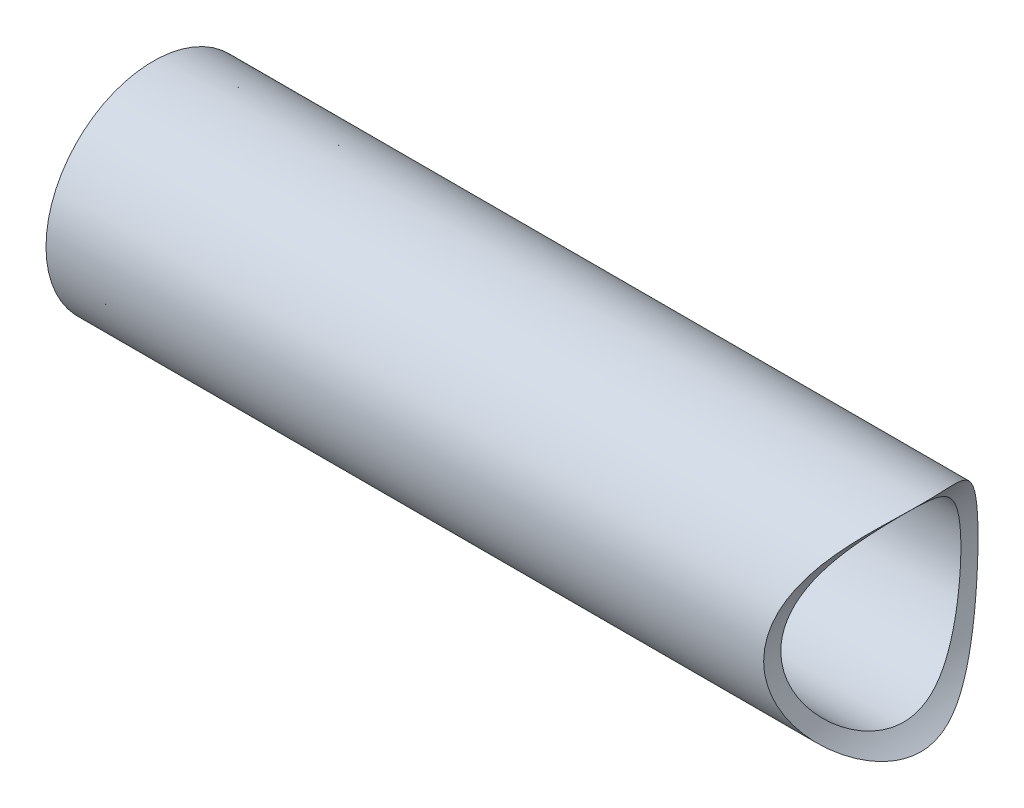
ISO-10303-21;
HEADER;
FILE_DESCRIPTION(('STEP AP214'),'2;1');
FILE_NAME('part.step','',(''),(''),'','','');
FILE_SCHEMA(('AUTOMOTIVE_DESIGN { 1 0 10303 214 1 1 1 1 }'));
ENDSEC;
DATA;
#1=APPLICATION_CONTEXT('core data for automotive mechanical design processes');
#2=APPLICATION_PROTOCOL_DEFINITION('international standard','automotive_design',2000,#1);
#3=PRODUCT_CONTEXT('',#1,'mechanical');
#4=PRODUCT('Part','Part','',(#3));
#5=PRODUCT_RELATED_PRODUCT_CATEGORY('part','',(#4));
#6=PRODUCT_DEFINITION_FORMATION('','',#4);
#7=PRODUCT_DEFINITION_CONTEXT('part definition',#1,'design');
#8=PRODUCT_DEFINITION('design','',#6,#7);
#9=PRODUCT_DEFINITION_SHAPE('','',#8);
#10=(LENGTH_UNIT() NAMED_UNIT(*) SI_UNIT(.MILLI.,.METRE.));
#11=(NAMED_UNIT(*) PLANE_ANGLE_UNIT() SI_UNIT($,.RADIAN.));
#12=(NAMED_UNIT(*) SI_UNIT($,.STERADIAN.) SOLID_ANGLE_UNIT());
#13=UNCERTAINTY_MEASURE_WITH_UNIT(LENGTH_MEASURE(1.E-05),#10,'distance_accuracy_value','');
#14=(GEOMETRIC_REPRESENTATION_CONTEXT(3) GLOBAL_UNCERTAINTY_ASSIGNED_CONTEXT((#13)) GLOBAL_UNIT_ASSIGNED_CONTEXT((#10,
#11,#12)) REPRESENTATION_CONTEXT('',''));
#15=CARTESIAN_POINT('',(0.,0.,0.));
#16=DIRECTION('',(0.,0.,1.));
#17=DIRECTION('',(1.,0.,0.));
#18=AXIS2_PLACEMENT_3D('',#15,#16,#17);
#19=CARTESIAN_POINT('',(76.2,0.,0.));
#20=DIRECTION('',(-1.,0.,0.));
#21=DIRECTION('',(0.,0.,1.));
#22=AXIS2_PLACEMENT_3D('',#19,#20,#21);
#23=CYLINDRICAL_SURFACE('',#22,9.525);
#24=CARTESIAN_POINT('',(63.7794,0.,9.525));
#25=CARTESIAN_POINT('',(63.779399362803,0.231436472206792,9.52500065416918));
#26=CARTESIAN_POINT('',(63.7858814172797,0.462864398155673,9.51655280556755));
#27=CARTESIAN_POINT('',(63.8116551576699,0.923867549602103,9.48290704231381));
#28=CARTESIAN_POINT('',(63.8309517494755,1.15344203144787,9.45770271263931));
#29=CARTESIAN_POINT('',(63.8819383576314,1.60913334522089,9.39092263303948));
#30=CARTESIAN_POINT('',(63.9136464232189,1.83524464096674,9.34932303989));
#31=CARTESIAN_POINT('',(63.9887299474654,2.28199399137669,9.25043088438929));
#32=CARTESIAN_POINT('',(64.0321044819407,2.50263247806925,9.19313956508417));
#33=CARTESIAN_POINT('',(64.1293079607293,2.93575812069893,9.06408939798475));
#34=CARTESIAN_POINT('',(64.1830732888483,3.14828590385986,8.99241849023557));
#35=CARTESIAN_POINT('',(64.3001767034404,3.56545273485888,8.8353187046899));
#36=CARTESIAN_POINT('',(64.3635149539591,3.77009164743443,8.74988959112518));
#37=CARTESIAN_POINT('',(64.4986085204896,4.17053717742766,8.56625645438419));
#38=CARTESIAN_POINT('',(64.5703603365211,4.36634742090213,8.46805774142585));
#39=CARTESIAN_POINT('',(64.7211618257725,4.7486659897162,8.25973441822145));
#40=CARTESIAN_POINT('',(64.800214216549,4.9351708111043,8.14960536437972));
#41=CARTESIAN_POINT('',(64.9720775144929,5.31531117666434,7.90749657884151));
#42=CARTESIAN_POINT('',(65.0654839683589,5.50798905726206,7.77443686581312));
#43=CARTESIAN_POINT('',(65.2580439625037,5.88124262987599,7.49605433717678));
#44=CARTESIAN_POINT('',(65.3571982718922,6.06181669530067,7.35072987925506));
#45=CARTESIAN_POINT('',(65.5598344791518,6.41084684109836,7.04840774969189));
#46=CARTESIAN_POINT('',(65.6633223899609,6.57928513834835,6.8913936066733));
#47=CARTESIAN_POINT('',(65.8728606671385,6.90353207519759,6.56654605685272));
#48=CARTESIAN_POINT('',(65.9789103530252,7.05934402185999,6.39871550386875));
#49=CARTESIAN_POINT('',(66.2145715292501,7.38999340039328,6.01585300120485));
#50=CARTESIAN_POINT('',(66.3444036148162,7.56184339037455,5.79836652951339));
#51=CARTESIAN_POINT('',(66.6022067561014,7.88648497876549,5.34845591569154));
#52=CARTESIAN_POINT('',(66.7301772207874,8.03927063640275,5.11602715130509));
#53=CARTESIAN_POINT('',(66.98035901494,8.32499414116026,4.63657959821472));
#54=CARTESIAN_POINT('',(67.1025751547944,8.45794877533152,4.38957339946405));
#55=CARTESIAN_POINT('',(67.3367559625488,8.70304160287996,3.88103172778459));
#56=CARTESIAN_POINT('',(67.4487264802147,8.81519171271391,3.61950468437537));
#57=CARTESIAN_POINT('',(67.6875780759142,9.04683015410528,3.00300092423355));
#58=CARTESIAN_POINT('',(67.8092650443693,9.15889779765476,2.64303684747714));
#59=CARTESIAN_POINT('',(67.9615600103406,9.29537962699193,2.08755617031534));
#60=CARTESIAN_POINT('',(68.0072674667644,9.33558904102313,1.89992349939526));
#61=CARTESIAN_POINT('',(68.0869075896764,9.40488294824299,1.52019487165071));
#62=CARTESIAN_POINT('',(68.1208464880973,9.43397333025127,1.32810133471719));
#63=CARTESIAN_POINT('',(68.1757323146001,9.48070466502802,0.938495407930132));
#64=CARTESIAN_POINT('',(68.1965333309205,9.49821712783424,0.74094675134673));
#65=CARTESIAN_POINT('',(68.2234754487842,9.52085482894756,0.344134768173952));
#66=CARTESIAN_POINT('',(68.2296171684056,9.52598058951382,0.144871514232479));
#67=CARTESIAN_POINT('',(68.2269039735099,9.52370967939927,-0.253502356034509));
#68=CARTESIAN_POINT('',(68.2180472152525,9.51631146916554,-0.452612950583561));
#69=CARTESIAN_POINT('',(68.1858166465852,9.48918368755466,-0.848791616912452));
#70=CARTESIAN_POINT('',(68.1624427956942,9.46945408179125,-1.04585968299512));
#71=CARTESIAN_POINT('',(68.1060797684732,9.42130244787611,-1.41227018136049));
#72=CARTESIAN_POINT('',(68.074630882085,9.39425158725262,-1.58203603454464));
#73=CARTESIAN_POINT('',(68.0025931921617,9.33145810633124,-1.91800632074385));
#74=CARTESIAN_POINT('',(67.9620011503969,9.2957124062244,-2.08420946906053));
#75=CARTESIAN_POINT('',(67.8282959569905,9.17606440343975,-2.57673988937795));
#76=CARTESIAN_POINT('',(67.7232647952137,9.07976020110264,-2.89692168303918));
#77=CARTESIAN_POINT('',(67.5115868113792,8.8769566703694,-3.46405584331542));
#78=CARTESIAN_POINT('',(67.4083931356038,8.77513794932227,-3.71406420474107));
#79=CARTESIAN_POINT('',(67.1918108003263,8.55265699236216,-4.20111250998644));
#80=CARTESIAN_POINT('',(67.0784165574875,8.43198440973093,-4.43814523594382));
#81=CARTESIAN_POINT('',(66.8452556500426,8.17254897525642,-4.89951889863966));
#82=CARTESIAN_POINT('',(66.7254759074781,8.03374808144068,-5.12383168189626));
#83=CARTESIAN_POINT('',(66.4831501211279,7.73889857479201,-5.55915092907223));
#84=CARTESIAN_POINT('',(66.3606045413706,7.58285283828382,-5.77015960283511));
#85=CARTESIAN_POINT('',(66.1117319537479,7.24865037001269,-6.18513553607477));
#86=CARTESIAN_POINT('',(65.9854084241279,7.06994890280247,-6.38866649524824));
#87=CARTESIAN_POINT('',(65.735715514632,6.69483595889118,-6.78073735269047));
#88=CARTESIAN_POINT('',(65.6123464346733,6.49842269376286,-6.96927573347671));
#89=CARTESIAN_POINT('',(65.3714365075329,6.08850959727958,-7.33008214397158));
#90=CARTESIAN_POINT('',(65.253886635298,5.87503765845942,-7.502375768871));
#91=CARTESIAN_POINT('',(65.0270040199746,5.4311650307461,-7.82969130532199));
#92=CARTESIAN_POINT('',(64.9176694143871,5.20076820249461,-7.98471713555689));
#93=CARTESIAN_POINT('',(64.7289598712517,4.76776406256953,-8.24899844084359));
#94=CARTESIAN_POINT('',(64.6477791738046,4.56787246945194,-8.36142140468544));
#95=CARTESIAN_POINT('',(64.4939694484531,4.15789169757287,-8.5726725985223));
#96=CARTESIAN_POINT('',(64.4213386889263,3.94780459592659,-8.67150358199145));
#97=CARTESIAN_POINT('',(64.2859940602519,3.51830121578144,-8.85447040001197));
#98=CARTESIAN_POINT('',(64.2232771511847,3.29888782332425,-8.93861074003843));
#99=CARTESIAN_POINT('',(64.1090201454439,2.85179539255544,-9.09113124308109));
#100=CARTESIAN_POINT('',(64.0574801564762,2.62411627461613,-9.15951125422386));
#101=CARTESIAN_POINT('',(63.9664138861099,2.16030411195371,-9.27989828905739));
#102=CARTESIAN_POINT('',(63.926975610251,1.92412247657988,-9.33178546769879));
#103=CARTESIAN_POINT('',(63.8615837604551,1.44666490781843,-9.41762232052789));
#104=CARTESIAN_POINT('',(63.83563024052,1.2053889540338,-9.45157192288161));
#105=CARTESIAN_POINT('',(63.7978951082864,0.719955398800779,-9.50088304153702));
#106=CARTESIAN_POINT('',(63.7861066835082,0.475799239642207,-9.51625349320997));
#107=CARTESIAN_POINT('',(63.7770004699775,-0.013229056675931,-9.52812963748889));
#108=CARTESIAN_POINT('',(63.7796812331561,-0.258101119736768,-9.52463721788116));
#109=CARTESIAN_POINT('',(63.7983000612292,-0.718309488258174,-9.50034366564152));
#110=CARTESIAN_POINT('',(63.8126865443844,-0.933820218489187,-9.48156817658183));
#111=CARTESIAN_POINT('',(63.8524372664706,-1.3620711874187,-9.42957622697699));
#112=CARTESIAN_POINT('',(63.8778016698848,-1.57481138455685,-9.39635955005813));
#113=CARTESIAN_POINT('',(63.9389971458371,-1.99610404206926,-9.31596427736967));
#114=CARTESIAN_POINT('',(63.9748287855012,-2.2046562748806,-9.26878492508555));
#115=CARTESIAN_POINT('',(64.0562709776962,-2.61633103995432,-9.16109790989434));
#116=CARTESIAN_POINT('',(64.1018819805888,-2.81945332167051,-9.10058963315665));
#117=CARTESIAN_POINT('',(64.2030327767432,-3.22307098357538,-8.96568879463712));
#118=CARTESIAN_POINT('',(64.2587464653645,-3.42344095053091,-8.89105185202455));
#119=CARTESIAN_POINT('',(64.378536077822,-3.81661958374558,-8.7295049917767));
#120=CARTESIAN_POINT('',(64.4426147766148,-4.0094257130983,-8.64259100064106));
#121=CARTESIAN_POINT('',(64.6458429224084,-4.57527665111366,-8.36474126032496));
#122=CARTESIAN_POINT('',(64.7960602846943,-4.9360476210105,-8.15659798994219));
#123=CARTESIAN_POINT('',(65.1436838109893,-5.67648706050478,-7.66367785805959));
#124=CARTESIAN_POINT('',(65.3447924376481,-6.04976098466468,-7.37195000900286));
#125=CARTESIAN_POINT('',(65.6579773243973,-6.57102834340501,-6.89944847469121));
#126=CARTESIAN_POINT('',(65.7644354149777,-6.73853193440252,-6.73589928068553));
#127=CARTESIAN_POINT('',(65.9794764271902,-7.06042597836889,-6.39769354577276));
#128=CARTESIAN_POINT('',(66.0880588841248,-7.21481926056848,-6.22303941563295));
#129=CARTESIAN_POINT('',(66.3278464186223,-7.54060641556453,-5.82611828074258));
#130=CARTESIAN_POINT('',(66.4591275264129,-7.70900035357449,-5.60142875546691));
#131=CARTESIAN_POINT('',(66.7186982579511,-8.02609532104232,-5.13678637263381));
#132=CARTESIAN_POINT('',(66.8469868317575,-8.17478952192015,-4.89682826492412));
#133=CARTESIAN_POINT('',(67.0962327112571,-8.45146900851773,-4.40209788648936));
#134=CARTESIAN_POINT('',(67.2172003908911,-8.57948404837262,-4.14734763052015));
#135=CARTESIAN_POINT('',(67.4469281711995,-8.81373537260308,-3.62300745078908));
#136=CARTESIAN_POINT('',(67.5556967033428,-8.91998674148399,-3.35342797075473));
#137=CARTESIAN_POINT('',(67.7794462126163,-9.13207717445722,-2.73183423512736));
#138=CARTESIAN_POINT('',(67.8895070204397,-9.23153406691642,-2.37571414667646));
#139=CARTESIAN_POINT('',(68.0235004369842,-9.34985053621102,-1.82779908361296));
#140=CARTESIAN_POINT('',(68.0629665672694,-9.38413242577134,-1.64299458129213));
#141=CARTESIAN_POINT('',(68.1300583006722,-9.44189143853665,-1.26962031166534));
#142=CARTESIAN_POINT('',(68.1576898827328,-9.46537401811433,-1.08105249614349));
#143=CARTESIAN_POINT('',(68.2000632101189,-9.50121586662459,-0.699669581741723));
#144=CARTESIAN_POINT('',(68.2146862886907,-9.51347276138143,-0.506831504724525));
#145=CARTESIAN_POINT('',(68.2298788272783,-9.52620462979875,-0.120213023644605));
#146=CARTESIAN_POINT('',(68.2304489533361,-9.52668016183883,0.0735673353231127));
#147=CARTESIAN_POINT('',(68.2175017127931,-9.51583383936208,0.460436906105756));
#148=CARTESIAN_POINT('',(68.2039757650115,-9.50450479864827,0.653525625031628));
#149=CARTESIAN_POINT('',(68.1635120034495,-9.47031454201255,1.03725259647442));
#150=CARTESIAN_POINT('',(68.1365725463107,-9.44745191304646,1.22789054579843));
#151=CARTESIAN_POINT('',(68.0665256385845,-9.3872398714988,1.62822875542732));
#152=CARTESIAN_POINT('',(68.0218552461002,-9.34847132907535,1.83744151729501));
#153=CARTESIAN_POINT('',(67.9194859049264,-9.25791914143967,2.24970096573933));
#154=CARTESIAN_POINT('',(67.8617848007023,-9.20613334275822,2.45274662584517));
#155=CARTESIAN_POINT('',(67.6725031187901,-9.03229175651722,3.05232285243323));
#156=CARTESIAN_POINT('',(67.5248755681115,-8.8918572144253,3.43862080190499));
#157=CARTESIAN_POINT('',(67.2515941405111,-8.61530393250275,4.07241175621149));
#158=CARTESIAN_POINT('',(67.1320914913077,-8.48987506809722,4.32752519598996));
#159=CARTESIAN_POINT('',(66.8854692545082,-8.21854031209348,4.82295869473442));
#160=CARTESIAN_POINT('',(66.7583467028124,-8.07262642192172,5.06327292222327));
#161=CARTESIAN_POINT('',(66.5005799080562,-7.76102530670267,5.52908154160372));
#162=CARTESIAN_POINT('',(66.3699321319541,-7.59531762751492,5.75456022341371));
#163=CARTESIAN_POINT('',(66.1087707984836,-7.24473427653126,6.1901189055732));
#164=CARTESIAN_POINT('',(65.978257225033,-7.05986126249871,6.40020103416943));
#165=CARTESIAN_POINT('',(65.717886615051,-6.66732271296994,6.80839282924573));
#166=CARTESIAN_POINT('',(65.5880957681832,-6.45927305118149,7.0061760596552));
#167=CARTESIAN_POINT('',(65.3349977175316,-6.02382368081853,7.3839176153565));
#168=CARTESIAN_POINT('',(65.2116913626445,-5.79642144891574,7.5638736095639));
#169=CARTESIAN_POINT('',(64.9748306396163,-5.32322840810642,7.90402499886499));
#170=CARTESIAN_POINT('',(64.8612590566319,-5.07747156086127,8.06425550478491));
#171=CARTESIAN_POINT('',(64.6466584303483,-4.56813758123173,8.36330439759627));
#172=CARTESIAN_POINT('',(64.5456240035404,-4.30456817326193,8.50213198124598));
#173=CARTESIAN_POINT('',(64.3840955804316,-3.83404789620802,8.72203395304521));
#174=CARTESIAN_POINT('',(64.3199985654127,-3.63088565364963,8.80860877816486));
#175=CARTESIAN_POINT('',(64.201213198017,-3.21664600434511,8.96816849458349));
#176=CARTESIAN_POINT('',(64.1465226502606,-3.00557045853359,9.04115655723143));
#177=CARTESIAN_POINT('',(64.0476773835362,-2.57694381497108,9.17252057206869));
#178=CARTESIAN_POINT('',(64.0035034927803,-2.3594053265205,9.23092312321565));
#179=CARTESIAN_POINT('',(63.9264867477976,-1.91889338005474,9.33244564934182));
#180=CARTESIAN_POINT('',(63.8936399290592,-1.69592185293494,9.37557097154482));
#181=CARTESIAN_POINT('',(63.8379433043172,-1.22892425191583,9.44856438615263));
#182=CARTESIAN_POINT('',(63.816042905947,-0.984585840166762,9.47717595428305));
#183=CARTESIAN_POINT('',(63.7867698897909,-0.493495415887894,9.51539564101578));
#184=CARTESIAN_POINT('',(63.7794006793389,-0.246742850905352,9.52499930256641));
#185=CARTESIAN_POINT('',(63.7794,0.,9.525));
#186=B_SPLINE_CURVE_WITH_KNOTS('',3,(#24,#25,#26,#27,#28,#29,#30,#31,#32,#33,#34,#35,#36,#37,
#38,#39,#40,#41,#42,#43,#44,#45,#46,#47,#48,#49,#50,#51,#52,#53,#54,#55,#56,#57,#58,#59,#60,#61,
#62,#63,#64,#65,#66,#67,#68,#69,#70,#71,#72,#73,#74,#75,#76,#77,#78,#79,#80,#81,#82,#83,#84,#85,
#86,#87,#88,#89,#90,#91,#92,#93,#94,#95,#96,#97,#98,#99,#100,#101,#102,#103,#104,#105,#106,#107,
#108,#109,#110,#111,#112,#113,#114,#115,#116,#117,#118,#119,#120,#121,#122,#123,#124,#125,#126,
#127,#128,#129,#130,#131,#132,#133,#134,#135,#136,#137,#138,#139,#140,#141,#142,#143,#144,#145,
#146,#147,#148,#149,#150,#151,#152,#153,#154,#155,#156,#157,#158,#159,#160,#161,#162,#163,#164,
#165,#166,#167,#168,#169,#170,#171,#172,#173,#174,#175,#176,#177,#178,#179,#180,#181,#182,#183,
#184,#185),.UNSPECIFIED.,.T.,.F.,(4,2,2,2,2,2,2,2,2,2,2,2,2,2,2,2,2,2,2,2,2,2,2,2,2,2,2,2,2,2,2,
2,2,2,2,2,2,2,2,2,2,2,2,2,2,2,2,2,2,2,2,2,2,2,2,2,2,2,2,2,2,2,2,2,2,2,2,2,2,2,2,2,2,2,2,2,2,2,2,
2,4),(0.,0.694052314381817,1.38837049168413,2.08370214671893,2.77897873582605,3.47012623194972,
4.16128557321997,4.85215841063313,5.54328946228478,6.29888945333361,7.05459078421412,
7.81137786048359,8.56796607591286,9.48524066866299,10.4028003898026,11.3195789297932,
12.2358307231354,13.4196450827176,14.0108467531759,14.6017348783564,15.1990751728768,
15.7963902813642,16.3937788222322,16.9911690289331,17.5149254872419,18.0388677367696,
19.0869542588054,19.9528908474694,20.8193043292906,21.6875660904866,22.5556832493657,
23.4513642096872,24.3471357117903,25.2414713900713,26.1356036961508,26.8647667366702,
27.5937818444899,28.3225729763421,29.0513711308512,29.7853500467609,30.5193319019871,
31.2529606187273,31.9865159156496,32.6361597683986,33.2858133551593,33.9355021473776,
34.5852208656608,35.2474202717584,35.90983991267,37.2337308951925,38.7719282241411,
39.5429913105487,40.3138875748722,41.2427622524398,42.1719580709167,43.0998047757498,
44.02700619308,45.1796590299573,45.7552470763935,46.3305439854622,46.9110366172618,
47.4915017364661,48.0723204284085,48.6532102969737,49.3044501867198,49.9557978832933,
51.2605454430235,52.1847086357085,53.1092336855447,54.0347225061591,54.9600831553503,
55.9040849718865,56.8482100633556,57.7906295641961,58.7326429752791,59.4218435013519,
60.110882955679,60.7986565093536,61.4861890951628,62.225970095486,62.965924542143),.UNSPECIFIED.);
#187=CARTESIAN_POINT('',(63.7794,0.,9.525));
#188=VERTEX_POINT('',#187);
#189=EDGE_CURVE('E55',#188,#188,#186,.T.);
#190=ORIENTED_EDGE('',*,*,#189,.T.);
#191=EDGE_LOOP('',(#190));
#192=FACE_BOUND('',#191,.T.);
#193=CARTESIAN_POINT('',(0.,0.,0.));
#194=DIRECTION('',(1.,0.,0.));
#195=DIRECTION('',(0.,0.,-1.));
#196=AXIS2_PLACEMENT_3D('',#193,#194,#195);
#197=CIRCLE('',#196,9.525);
#198=CARTESIAN_POINT('',(0.,0.,-9.525));
#199=VERTEX_POINT('',#198);
#200=EDGE_CURVE('E10',#199,#199,#197,.T.);
#201=ORIENTED_EDGE('',*,*,#200,.T.);
#202=EDGE_LOOP('',(#201));
#203=FACE_BOUND('',#202,.T.);
#204=ADVANCED_FACE('F30',(#192,#203),#23,.T.);
#205=CARTESIAN_POINT('',(0.,0.,0.));
#206=DIRECTION('',(1.,0.,0.));
#207=DIRECTION('',(0.,0.,-1.));
#208=AXIS2_PLACEMENT_3D('',#205,#206,#207);
#209=PLANE('',#208);
#210=CARTESIAN_POINT('',(0.,0.,0.));
#211=DIRECTION('',(-1.,0.,0.));
#212=DIRECTION('',(0.,0.,1.));
#213=AXIS2_PLACEMENT_3D('',#210,#211,#212);
#214=CIRCLE('',#213,8.509);
#215=CARTESIAN_POINT('',(0.,0.,8.509));
#216=VERTEX_POINT('',#215);
#217=EDGE_CURVE('E47',#216,#216,#214,.T.);
#218=ORIENTED_EDGE('',*,*,#217,.F.);
#219=EDGE_LOOP('',(#218));
#220=FACE_BOUND('',#219,.T.);
#221=ORIENTED_EDGE('',*,*,#200,.F.);
#222=EDGE_LOOP('',(#221));
#223=FACE_BOUND('',#222,.T.);
#224=ADVANCED_FACE('F76',(#220,#223),#209,.F.);
#225=CARTESIAN_POINT('',(1.524,0.,0.));
#226=DIRECTION('',(-1.,0.,0.));
#227=DIRECTION('',(0.,0.,1.));
#228=AXIS2_PLACEMENT_3D('',#225,#226,#227);
#229=CYLINDRICAL_SURFACE('',#228,8.509);
#230=CARTESIAN_POINT('',(1.524,0.,0.));
#231=DIRECTION('',(-1.,0.,0.));
#232=DIRECTION('',(0.,0.,1.));
#233=AXIS2_PLACEMENT_3D('',#230,#231,#232);
#234=CIRCLE('',#233,8.509);
#235=CARTESIAN_POINT('',(1.524,0.,8.509));
#236=VERTEX_POINT('',#235);
#237=EDGE_CURVE('E43',#236,#236,#234,.T.);
#238=ORIENTED_EDGE('',*,*,#237,.F.);
#239=EDGE_LOOP('',(#238));
#240=FACE_BOUND('',#239,.T.);
#241=ORIENTED_EDGE('',*,*,#217,.T.);
#242=EDGE_LOOP('',(#241));
#243=FACE_BOUND('',#242,.T.);
#244=ADVANCED_FACE('F73',(#240,#243),#229,.F.);
#245=CARTESIAN_POINT('',(1.524,0.,0.));
#246=DIRECTION('',(-1.,0.,0.));
#247=DIRECTION('',(0.,0.,1.));
#248=AXIS2_PLACEMENT_3D('',#245,#246,#247);
#249=PLANE('',#248);
#250=CARTESIAN_POINT('',(1.524,0.,0.));
#251=DIRECTION('',(-1.,0.,0.));
#252=DIRECTION('',(0.,0.,1.));
#253=AXIS2_PLACEMENT_3D('',#250,#251,#252);
#254=CIRCLE('',#253,8.001);
#255=CARTESIAN_POINT('',(1.524,0.,8.001));
#256=VERTEX_POINT('',#255);
#257=EDGE_CURVE('E51',#256,#256,#254,.T.);
#258=ORIENTED_EDGE('',*,*,#257,.F.);
#259=EDGE_LOOP('',(#258));
#260=FACE_BOUND('',#259,.T.);
#261=ORIENTED_EDGE('',*,*,#237,.T.);
#262=EDGE_LOOP('',(#261));
#263=FACE_BOUND('',#262,.T.);
#264=ADVANCED_FACE('F69',(#260,#263),#249,.T.);
#265=CARTESIAN_POINT('',(76.2,0.,0.));
#266=DIRECTION('',(-1.,0.,0.));
#267=DIRECTION('',(0.,0.,1.));
#268=AXIS2_PLACEMENT_3D('',#265,#266,#267);
#269=CYLINDRICAL_SURFACE('',#268,8.001);
#270=CARTESIAN_POINT('',(63.7794,0.,8.001));
#271=CARTESIAN_POINT('',(63.7793946400964,-0.202343962933734,8.00100568253379));
#272=CARTESIAN_POINT('',(63.7843521565646,-0.404634301311018,7.99331812680323));
#273=CARTESIAN_POINT('',(63.8040456436651,-0.807641948046263,7.96269610871055));
#274=CARTESIAN_POINT('',(63.8187835641105,-1.00835893466737,7.93975860613026));
#275=CARTESIAN_POINT('',(63.8576955741624,-1.40674639939101,7.87894141337915));
#276=CARTESIAN_POINT('',(63.8818776369006,-1.60441415624606,7.84104909745644));
#277=CARTESIAN_POINT('',(63.9390933478802,-1.99510666034114,7.75085437489078));
#278=CARTESIAN_POINT('',(63.9721266792101,-2.18813157354434,7.69855248416757));
#279=CARTESIAN_POINT('',(64.0461061136419,-2.56735432883484,7.58049718418202));
#280=CARTESIAN_POINT('',(64.0870118603721,-2.75358146085736,7.51481228357135));
#281=CARTESIAN_POINT('',(64.1759862198577,-3.11926757327123,7.37053783772798));
#282=CARTESIAN_POINT('',(64.2240576091601,-3.29872389617889,7.29194328904945));
#283=CARTESIAN_POINT('',(64.3263748993374,-3.64989811988732,7.12265542503683));
#284=CARTESIAN_POINT('',(64.3806181398669,-3.82161931065637,7.03196731969151));
#285=CARTESIAN_POINT('',(64.4942816038626,-4.15678124396449,6.83919444174471));
#286=CARTESIAN_POINT('',(64.5537037509152,-4.32021887381087,6.73710543054219));
#287=CARTESIAN_POINT('',(64.7482305904397,-4.82328263281791,6.39720589334998));
#288=CARTESIAN_POINT('',(64.8910087021521,-5.14684395183643,6.13958946996772));
#289=CARTESIAN_POINT('',(65.184904540806,-5.74904373316614,5.5797806697578));
#290=CARTESIAN_POINT('',(65.3360335741384,-6.02761918416159,5.27752688427977));
#291=CARTESIAN_POINT('',(65.5704389857406,-6.42746748113265,4.77063494263404));
#292=CARTESIAN_POINT('',(65.6551490509337,-6.56513696701627,4.57938308321824));
#293=CARTESIAN_POINT('',(65.8206697834638,-6.82380847263964,4.18418605343312));
#294=CARTESIAN_POINT('',(65.9014796482172,-6.94480707126332,3.98023829010391));
#295=CARTESIAN_POINT('',(66.0562467732735,-7.16896876581615,3.56067251075514));
#296=CARTESIAN_POINT('',(66.1302132933233,-7.27215613092057,3.34507090883863));
#297=CARTESIAN_POINT('',(66.2683458109258,-7.45969981233103,2.90284270432325));
#298=CARTESIAN_POINT('',(66.3325162059907,-7.54406458605504,2.67622110923339));
#299=CARTESIAN_POINT('',(66.4321468249734,-7.67235472878842,2.27645230875051));
#300=CARTESIAN_POINT('',(66.4706638589501,-7.72103375481348,2.10557991639857));
#301=CARTESIAN_POINT('',(66.5396422371559,-7.80716600410319,1.7595224468521));
#302=CARTESIAN_POINT('',(66.5701087165434,-7.84462638538055,1.58434019710161));
#303=CARTESIAN_POINT('',(66.6219283447228,-7.90781397071006,1.23073118250659));
#304=CARTESIAN_POINT('',(66.6432914254727,-7.93355396401226,1.05230817619955));
#305=CARTESIAN_POINT('',(66.6761406746397,-7.972958729551,0.693216939486897));
#306=CARTESIAN_POINT('',(66.6876267416012,-7.98662337775077,0.51254868603765));
#307=CARTESIAN_POINT('',(66.7002759651701,-8.00166527272688,0.149743067270615));
#308=CARTESIAN_POINT('',(66.7014052672797,-8.00300222243674,-0.0323971695041566));
#309=CARTESIAN_POINT('',(66.6932052720287,-7.99325949412813,-0.396106150418002));
#310=CARTESIAN_POINT('',(66.683875924078,-7.98217975604839,-0.57767489178841));
#311=CARTESIAN_POINT('',(66.6551322039937,-7.94778591533977,-0.938965385584156));
#312=CARTESIAN_POINT('',(66.6357105530713,-7.92446298252817,-1.11868570936035));
#313=CARTESIAN_POINT('',(66.5875352133659,-7.86595545752498,-1.47490051215752));
#314=CARTESIAN_POINT('',(66.5587813306084,-7.83077061877814,-1.651394924046));
#315=CARTESIAN_POINT('',(66.4940273244739,-7.75035282954256,-1.99451090304557));
#316=CARTESIAN_POINT('',(66.4582906588384,-7.70548033648056,-2.16126732727847));
#317=CARTESIAN_POINT('',(66.3800982826475,-7.60558070573934,-2.49012104369776));
#318=CARTESIAN_POINT('',(66.3376402680587,-7.55055008484402,-2.65221671561231));
#319=CARTESIAN_POINT('',(66.2018759686064,-7.37097836842628,-3.13059444655762));
#320=CARTESIAN_POINT('',(66.1001437267516,-7.23191492894561,-3.43914543228212));
#321=CARTESIAN_POINT('',(65.8618646957808,-6.88810886980982,-4.09035016179098));
#322=CARTESIAN_POINT('',(65.7223977662518,-6.67584592726078,-4.42791548383197));
#323=CARTESIAN_POINT('',(65.4368791316555,-6.20502747147192,-5.06666741460046));
#324=CARTESIAN_POINT('',(65.2908197157638,-5.94641664009327,-5.3678098237134));
#325=CARTESIAN_POINT('',(65.0620100472751,-5.50013958839756,-5.81549323279107));
#326=CARTESIAN_POINT('',(64.9776248875144,-5.326280029984,-5.97517506357792));
#327=CARTESIAN_POINT('',(64.8127250337856,-4.96395518330921,-6.27941849348534));
#328=CARTESIAN_POINT('',(64.7322109982055,-4.77548742467182,-6.42397752545192));
#329=CARTESIAN_POINT('',(64.577266849983,-4.3849167260173,-6.69665507687266));
#330=CARTESIAN_POINT('',(64.5028316745189,-4.18282539396592,-6.82478732923586));
#331=CARTESIAN_POINT('',(64.3620088991569,-3.76585300183825,-7.06342766698651));
#332=CARTESIAN_POINT('',(64.295619066058,-3.5509755157087,-7.17394064577722));
#333=CARTESIAN_POINT('',(64.1849873013877,-3.15349123836704,-7.35590574415692));
#334=CARTESIAN_POINT('',(64.1389636831921,-2.97292972941127,-7.43075839572842));
#335=CARTESIAN_POINT('',(64.0542489456726,-2.60530140744678,-7.56748621455111));
#336=CARTESIAN_POINT('',(64.0155564910518,-2.41823578645619,-7.62936374530827));
#337=CARTESIAN_POINT('',(63.9463495781067,-2.03875675339343,-7.73941049085683));
#338=CARTESIAN_POINT('',(63.9158300439369,-1.84634674283533,-7.78758821515812));
#339=CARTESIAN_POINT('',(63.8636286716177,-1.45731248608469,-7.8696733493385));
#340=CARTESIAN_POINT('',(63.8419469934688,-1.26068816366412,-7.90358050086363));
#341=CARTESIAN_POINT('',(63.8078786249426,-0.863949685194311,-7.95674479502144));
#342=CARTESIAN_POINT('',(63.7955251174134,-0.663825637622842,-7.9759496408611));
#343=CARTESIAN_POINT('',(63.7805459493643,-0.262332965606738,-7.9992259212937));
#344=CARTESIAN_POINT('',(63.7779202924526,-0.0609643407004882,-8.00329735027331));
#345=CARTESIAN_POINT('',(63.7824627324994,0.341403235934272,-7.99624508151412));
#346=CARTESIAN_POINT('',(63.7896312794518,0.542402170252499,-7.98512068560425));
#347=CARTESIAN_POINT('',(63.8135839096452,0.942414478991548,-7.94784273989207));
#348=CARTESIAN_POINT('',(63.8303677213917,1.14142790931321,-7.92168961443765));
#349=CARTESIAN_POINT('',(63.8719390987528,1.52489749230377,-7.85661312885272));
#350=CARTESIAN_POINT('',(63.8962255936347,1.70954456912131,-7.81848727781831));
#351=CARTESIAN_POINT('',(63.9524986078993,2.07464280901035,-7.72962932491453));
#352=CARTESIAN_POINT('',(63.9844877632522,2.25509251244314,-7.6788929073213));
#353=CARTESIAN_POINT('',(64.0555135858445,2.61067394041211,-7.56539523057578));
#354=CARTESIAN_POINT('',(64.0945481951005,2.78580720048136,-7.5026374825379));
#355=CARTESIAN_POINT('',(64.178949788136,3.13002899466611,-7.36568071837875));
#356=CARTESIAN_POINT('',(64.2243191884561,3.29911519093464,-7.29147733494002));
#357=CARTESIAN_POINT('',(64.3240449564697,3.64241461059529,-7.12654406778394));
#358=CARTESIAN_POINT('',(64.3788129446052,3.8161223607132,-7.03500953221609));
#359=CARTESIAN_POINT('',(64.4936455029448,4.15507616844295,-6.84029219591951));
#360=CARTESIAN_POINT('',(64.5537122889448,4.32031864003875,-6.7371045170992));
#361=CARTESIAN_POINT('',(64.7403058729329,4.80263243268735,-6.41102439407078));
#362=CARTESIAN_POINT('',(64.8732437510453,5.10634956414892,-6.17158603361194));
#363=CARTESIAN_POINT('',(65.0888348144914,5.5539677631477,-5.76356533039375));
#364=CARTESIAN_POINT('',(65.1689895628863,5.71115467541917,-5.60781611873476));
#365=CARTESIAN_POINT('',(65.3300456540849,6.01202573716453,-5.28397184257657));
#366=CARTESIAN_POINT('',(65.4109471616974,6.15570682369188,-5.11587399289105));
#367=CARTESIAN_POINT('',(65.5715054469686,6.42896167386975,-4.76795739086536));
#368=CARTESIAN_POINT('',(65.6511618828033,6.55853161972917,-4.58813548749718));
#369=CARTESIAN_POINT('',(65.8070747486137,6.80289661447325,-4.21733097077083));
#370=CARTESIAN_POINT('',(65.8833316920624,6.91769389965591,-4.02635005305353));
#371=CARTESIAN_POINT('',(66.020599533957,7.11785606349911,-3.65923268781192));
#372=CARTESIAN_POINT('',(66.082305058479,7.20510719618136,-3.48438349435571));
#373=CARTESIAN_POINT('',(66.1997347985259,7.36722608054,-3.12705408544431));
#374=CARTESIAN_POINT('',(66.2554586803237,7.44209314141164,-2.94457344500476));
#375=CARTESIAN_POINT('',(66.3591314932601,7.57865169472792,-2.57278358656977));
#376=CARTESIAN_POINT('',(66.4070876198348,7.64035539766742,-2.38348088905907));
#377=CARTESIAN_POINT('',(66.4935234864995,7.74987040388961,-1.99886480677391));
#378=CARTESIAN_POINT('',(66.5320080031076,7.79768871175284,-1.8035545077608));
#379=CARTESIAN_POINT('',(66.5982619277052,7.87913242862878,-1.40600731199598));
#380=CARTESIAN_POINT('',(66.6259159203961,7.91260530255462,-1.20371954928518));
#381=CARTESIAN_POINT('',(66.6686017488969,7.9639737488639,-0.795840808630466));
#382=CARTESIAN_POINT('',(66.6836339511313,7.98186977346105,-0.590249926756372));
#383=CARTESIAN_POINT('',(66.7002868673064,8.0016827100989,-0.177899818012241));
#384=CARTESIAN_POINT('',(66.7019172855936,8.00361118438693,0.0288584549574446));
#385=CARTESIAN_POINT('',(66.6917021587491,7.99147292562387,0.441554464415409));
#386=CARTESIAN_POINT('',(66.6798578166255,7.97740762047561,0.64749227250657));
#387=CARTESIAN_POINT('',(66.6460959658884,7.93692565662428,1.02551818847139));
#388=CARTESIAN_POINT('',(66.6259755036639,7.91270197292885,1.19800965443749));
#389=CARTESIAN_POINT('',(66.5772178923248,7.85333220358315,1.5399038499158));
#390=CARTESIAN_POINT('',(66.5485783326627,7.81818302634936,1.70930569077541));
#391=CARTESIAN_POINT('',(66.4512174796481,7.69697435573688,2.21159593034256));
#392=CARTESIAN_POINT('',(66.3710555153456,7.59515541801356,2.53855372398554));
#393=CARTESIAN_POINT('',(66.1575702653724,7.31176230440242,3.28051083478574));
#394=CARTESIAN_POINT('',(66.0154456534109,7.11480057911603,3.68709718165581));
#395=CARTESIAN_POINT('',(65.7882333180731,6.77386582391524,4.26390122676292));
#396=CARTESIAN_POINT('',(65.7100577011854,6.65246859217749,4.45085774537588));
#397=CARTESIAN_POINT('',(65.5511840594205,6.39506441400592,4.81336842098167));
#398=CARTESIAN_POINT('',(65.4704862412935,6.25905866284772,4.98892350896152));
#399=CARTESIAN_POINT('',(65.3076292290097,5.9712042873578,5.33021797904725));
#400=CARTESIAN_POINT('',(65.2254646802064,5.81917258812977,5.49579996835483));
#401=CARTESIAN_POINT('',(65.0627217248512,5.50129193339817,5.81397841224335));
#402=CARTESIAN_POINT('',(64.9821432588944,5.33544349660727,5.96657535387899));
#403=CARTESIAN_POINT('',(64.8245397198129,4.99060334774568,6.25785758168823));
#404=CARTESIAN_POINT('',(64.7475120369037,4.81162154766495,6.39655317616738));
#405=CARTESIAN_POINT('',(64.5987856924976,4.44105531166973,6.65917257701141));
#406=CARTESIAN_POINT('',(64.5270862217235,4.2494727979859,6.78309862838697));
#407=CARTESIAN_POINT('',(64.3992745460008,3.8791281647872,7.00061146239721));
#408=CARTESIAN_POINT('',(64.3423332074114,3.70174134683343,7.09605457117396));
#409=CARTESIAN_POINT('',(64.2350329129579,3.33866577780916,7.27393747901115));
#410=CARTESIAN_POINT('',(64.1846728590754,3.15297841855276,7.35637944765151));
#411=CARTESIAN_POINT('',(64.0916615546625,2.77441360685396,7.50733569614862));
#412=CARTESIAN_POINT('',(64.0490008710387,2.58154530683503,7.57586703201601));
#413=CARTESIAN_POINT('',(63.9722939379863,2.18961290052703,7.69829590256203));
#414=CARTESIAN_POINT('',(63.938245702826,1.99055023435221,7.75219681071903));
#415=CARTESIAN_POINT('',(63.8665490922636,1.49788525045357,7.86520343396229));
#416=CARTESIAN_POINT('',(63.8340179623342,1.20156078336548,7.91598854827601));
#417=CARTESIAN_POINT('',(63.7904467546068,0.603451369673545,7.98388362488348));
#418=CARTESIAN_POINT('',(63.7794079908544,0.301666090333538,8.00099152814976));
#419=CARTESIAN_POINT('',(63.7794,0.,8.001));
#420=B_SPLINE_CURVE_WITH_KNOTS('',3,(#270,#271,#272,#273,#274,#275,#276,#277,#278,#279,#280,
#281,#282,#283,#284,#285,#286,#287,#288,#289,#290,#291,#292,#293,#294,#295,#296,#297,#298,#299,
#300,#301,#302,#303,#304,#305,#306,#307,#308,#309,#310,#311,#312,#313,#314,#315,#316,#317,#318,
#319,#320,#321,#322,#323,#324,#325,#326,#327,#328,#329,#330,#331,#332,#333,#334,#335,#336,#337,
#338,#339,#340,#341,#342,#343,#344,#345,#346,#347,#348,#349,#350,#351,#352,#353,#354,#355,#356,
#357,#358,#359,#360,#361,#362,#363,#364,#365,#366,#367,#368,#369,#370,#371,#372,#373,#374,#375,
#376,#377,#378,#379,#380,#381,#382,#383,#384,#385,#386,#387,#388,#389,#390,#391,#392,#393,#394,
#395,#396,#397,#398,#399,#400,#401,#402,#403,#404,#405,#406,#407,#408,#409,#410,#411,#412,#413,
#414,#415,#416,#417,#418,#419),.UNSPECIFIED.,.T.,.F.,(4,2,2,2,2,2,2,2,2,2,2,2,2,2,2,2,2,2,2,2,2,
2,2,2,2,2,2,2,2,2,2,2,2,2,2,2,2,2,2,2,2,2,2,2,2,2,2,2,2,2,2,2,2,2,2,2,2,2,2,2,2,2,2,2,2,2,2,2,2,
2,2,2,2,2,4),(0.,0.606734417165771,1.21358982874262,1.82095868389013,2.42830579565714,
3.03261862693975,3.63716622930785,4.24145422468606,4.84596763343516,6.1532673457957,
7.46238258973397,8.21284393756076,8.96345906265064,9.71304320172174,10.4622898542588,
11.0071688909521,11.5516995253528,12.0956345372686,12.6395751363672,13.1852931532681,
13.7310138098959,14.2771285995393,14.8232547411335,15.3517766774085,15.8804801813436,
16.9373324089003,18.2003419900225,19.4648691885644,20.2161639087343,20.967585957864,
21.7183756582824,22.4689564771647,23.0707686292412,23.6724710617527,24.2737989318018,
24.875137687802,25.4786056212052,26.0820737784488,26.6855696629261,27.2890485080643,
27.8587187096296,28.4285841389531,28.998283378665,29.5682005390495,30.1790946492072,
30.7902454387315,32.0123436469887,32.7178400312182,33.4234960288179,34.1293424709357,
34.8350819354022,35.4492893576822,36.0635310299604,36.6772004223563,37.2905597051697,
37.9102881066852,38.5299985161781,39.1492601484897,39.7684664983071,40.29390354557,
40.8194894111543,41.8707070726593,43.283607921752,43.9917321808797,44.6997985450338,
45.4170756707716,46.1343258803718,46.851040228094,47.5676454939654,48.1949951283968,
48.8222399621163,49.4487110142052,50.0750374918929,50.9795369755081,51.8840917585788),.UNSPECIFIED.);
#421=CARTESIAN_POINT('',(63.7794,0.,8.001));
#422=VERTEX_POINT('',#421);
#423=EDGE_CURVE('E34',#422,#422,#420,.T.);
#424=ORIENTED_EDGE('',*,*,#423,.T.);
#425=EDGE_LOOP('',(#424));
#426=FACE_BOUND('',#425,.T.);
#427=ORIENTED_EDGE('',*,*,#257,.T.);
#428=EDGE_LOOP('',(#427));
#429=FACE_BOUND('',#428,.T.);
#430=ADVANCED_FACE('F63',(#426,#429),#269,.F.);
#431=CARTESIAN_POINT('',(76.2,0.,-244.475));
#432=DIRECTION('',(0.,0.,1.));
#433=DIRECTION('',(1.,0.,0.));
#434=AXIS2_PLACEMENT_3D('',#431,#432,#433);
#435=CYLINDRICAL_SURFACE('',#434,12.4206);
#436=ORIENTED_EDGE('',*,*,#423,.F.);
#437=EDGE_LOOP('',(#436));
#438=FACE_BOUND('',#437,.T.);
#439=ORIENTED_EDGE('',*,*,#189,.F.);
#440=EDGE_LOOP('',(#439));
#441=FACE_BOUND('',#440,.T.);
#442=ADVANCED_FACE('F60',(#438,#441),#435,.F.);
#443=CLOSED_SHELL('',(#204,#224,#244,#264,#430,#442));
#444=MANIFOLD_SOLID_BREP('B2',#443);
#445=ADVANCED_BREP_SHAPE_REPRESENTATION('',(#18,#444),#14);
#446=SHAPE_DEFINITION_REPRESENTATION(#9,#445);
ENDSEC;
END-ISO-10303-21;
